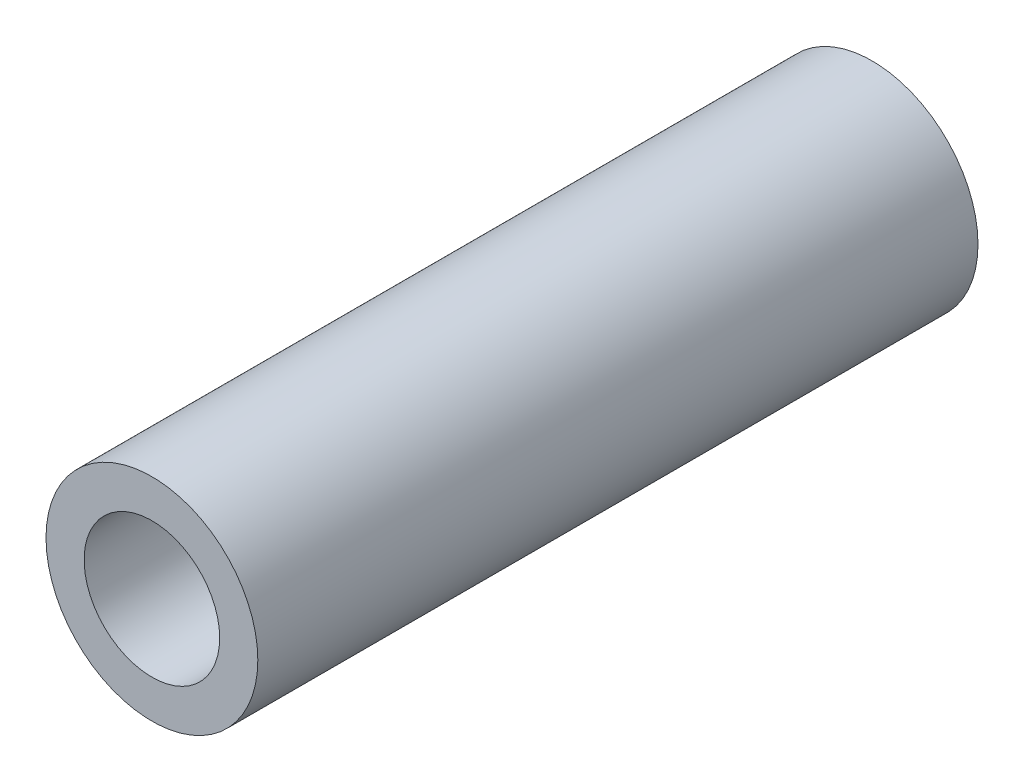
ISO-10303-21;
HEADER;
FILE_DESCRIPTION(('STEP AP214'),'2;1');
FILE_NAME('part.step','',(''),(''),'','','');
FILE_SCHEMA(('AUTOMOTIVE_DESIGN { 1 0 10303 214 1 1 1 1 }'));
ENDSEC;
DATA;
#1=APPLICATION_CONTEXT('core data for automotive mechanical design processes');
#2=APPLICATION_PROTOCOL_DEFINITION('international standard','automotive_design',2000,#1);
#3=PRODUCT_CONTEXT('',#1,'mechanical');
#4=PRODUCT('Part','Part','',(#3));
#5=PRODUCT_RELATED_PRODUCT_CATEGORY('part','',(#4));
#6=PRODUCT_DEFINITION_FORMATION('','',#4);
#7=PRODUCT_DEFINITION_CONTEXT('part definition',#1,'design');
#8=PRODUCT_DEFINITION('design','',#6,#7);
#9=PRODUCT_DEFINITION_SHAPE('','',#8);
#10=(LENGTH_UNIT() NAMED_UNIT(*) SI_UNIT(.MILLI.,.METRE.));
#11=(NAMED_UNIT(*) PLANE_ANGLE_UNIT() SI_UNIT($,.RADIAN.));
#12=(NAMED_UNIT(*) SI_UNIT($,.STERADIAN.) SOLID_ANGLE_UNIT());
#13=UNCERTAINTY_MEASURE_WITH_UNIT(LENGTH_MEASURE(1.E-05),#10,'distance_accuracy_value','');
#14=(GEOMETRIC_REPRESENTATION_CONTEXT(3) GLOBAL_UNCERTAINTY_ASSIGNED_CONTEXT((#13)) GLOBAL_UNIT_ASSIGNED_CONTEXT((#10,
#11,#12)) REPRESENTATION_CONTEXT('',''));
#15=CARTESIAN_POINT('',(0.,0.,0.));
#16=DIRECTION('',(0.,0.,1.));
#17=DIRECTION('',(1.,0.,0.));
#18=AXIS2_PLACEMENT_3D('',#15,#16,#17);
#19=CARTESIAN_POINT('',(0.,0.,17.));
#20=DIRECTION('',(0.,0.,1.));
#21=DIRECTION('',(1.,0.,0.));
#22=AXIS2_PLACEMENT_3D('',#19,#20,#21);
#23=PLANE('',#22);
#24=CARTESIAN_POINT('',(0.,0.,17.));
#25=DIRECTION('',(0.,0.,1.));
#26=DIRECTION('',(1.,0.,0.));
#27=AXIS2_PLACEMENT_3D('',#24,#25,#26);
#28=CIRCLE('',#27,2.5);
#29=CARTESIAN_POINT('',(2.5,0.,17.));
#30=VERTEX_POINT('',#29);
#31=EDGE_CURVE('E10',#30,#30,#28,.T.);
#32=ORIENTED_EDGE('',*,*,#31,.T.);
#33=EDGE_LOOP('',(#32));
#34=FACE_BOUND('',#33,.T.);
#35=CARTESIAN_POINT('',(0.,0.,17.));
#36=DIRECTION('',(0.,0.,1.));
#37=DIRECTION('',(1.,0.,0.));
#38=AXIS2_PLACEMENT_3D('',#35,#36,#37);
#39=CIRCLE('',#38,1.6);
#40=CARTESIAN_POINT('',(1.6,0.,17.));
#41=VERTEX_POINT('',#40);
#42=EDGE_CURVE('E42',#41,#41,#39,.T.);
#43=ORIENTED_EDGE('',*,*,#42,.F.);
#44=EDGE_LOOP('',(#43));
#45=FACE_BOUND('',#44,.T.);
#46=ADVANCED_FACE('F31',(#34,#45),#23,.T.);
#47=CARTESIAN_POINT('',(0.,0.,0.));
#48=DIRECTION('',(0.,0.,1.));
#49=DIRECTION('',(1.,0.,0.));
#50=AXIS2_PLACEMENT_3D('',#47,#48,#49);
#51=PLANE('',#50);
#52=CARTESIAN_POINT('',(0.,0.,0.));
#53=DIRECTION('',(0.,0.,1.));
#54=DIRECTION('',(1.,0.,0.));
#55=AXIS2_PLACEMENT_3D('',#52,#53,#54);
#56=CIRCLE('',#55,2.5);
#57=CARTESIAN_POINT('',(2.5,0.,0.));
#58=VERTEX_POINT('',#57);
#59=EDGE_CURVE('E35',#58,#58,#56,.T.);
#60=ORIENTED_EDGE('',*,*,#59,.F.);
#61=EDGE_LOOP('',(#60));
#62=FACE_BOUND('',#61,.T.);
#63=CARTESIAN_POINT('',(0.,0.,0.));
#64=DIRECTION('',(0.,0.,1.));
#65=DIRECTION('',(1.,0.,0.));
#66=AXIS2_PLACEMENT_3D('',#63,#64,#65);
#67=CIRCLE('',#66,1.6);
#68=CARTESIAN_POINT('',(1.6,0.,0.));
#69=VERTEX_POINT('',#68);
#70=EDGE_CURVE('E44',#69,#69,#67,.T.);
#71=ORIENTED_EDGE('',*,*,#70,.T.);
#72=EDGE_LOOP('',(#71));
#73=FACE_BOUND('',#72,.T.);
#74=ADVANCED_FACE('F54',(#62,#73),#51,.F.);
#75=CARTESIAN_POINT('',(0.,0.,17.));
#76=DIRECTION('',(0.,0.,-1.));
#77=DIRECTION('',(-1.,0.,0.));
#78=AXIS2_PLACEMENT_3D('',#75,#76,#77);
#79=CYLINDRICAL_SURFACE('',#78,2.5);
#80=ORIENTED_EDGE('',*,*,#31,.F.);
#81=EDGE_LOOP('',(#80));
#82=FACE_BOUND('',#81,.T.);
#83=ORIENTED_EDGE('',*,*,#59,.T.);
#84=EDGE_LOOP('',(#83));
#85=FACE_BOUND('',#84,.T.);
#86=ADVANCED_FACE('F33',(#82,#85),#79,.T.);
#87=CARTESIAN_POINT('',(0.,0.,17.));
#88=DIRECTION('',(0.,0.,-1.));
#89=DIRECTION('',(-1.,0.,0.));
#90=AXIS2_PLACEMENT_3D('',#87,#88,#89);
#91=CYLINDRICAL_SURFACE('',#90,1.6);
#92=ORIENTED_EDGE('',*,*,#42,.T.);
#93=EDGE_LOOP('',(#92));
#94=FACE_BOUND('',#93,.T.);
#95=ORIENTED_EDGE('',*,*,#70,.F.);
#96=EDGE_LOOP('',(#95));
#97=FACE_BOUND('',#96,.T.);
#98=ADVANCED_FACE('F50',(#94,#97),#91,.F.);
#99=CLOSED_SHELL('',(#46,#74,#86,#98));
#100=MANIFOLD_SOLID_BREP('B2',#99);
#101=ADVANCED_BREP_SHAPE_REPRESENTATION('',(#18,#100),#14);
#102=SHAPE_DEFINITION_REPRESENTATION(#9,#101);
ENDSEC;
END-ISO-10303-21;
